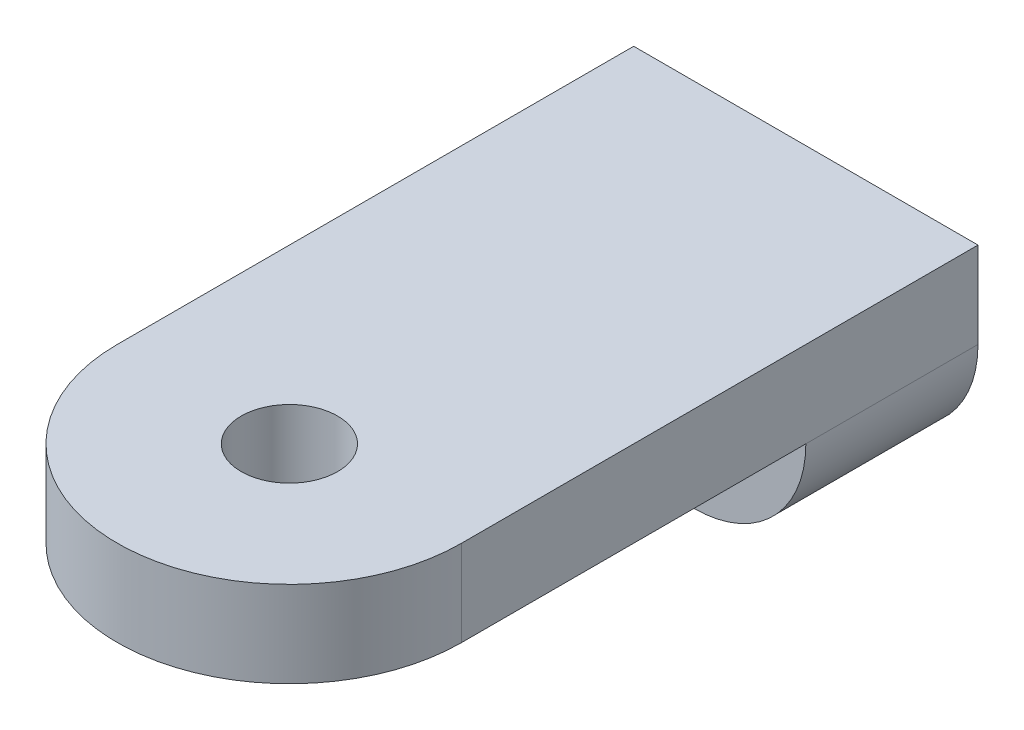
ISO-10303-21;
HEADER;
FILE_DESCRIPTION(('STEP AP214'),'2;1');
FILE_NAME('part.step','',(''),(''),'','','');
FILE_SCHEMA(('AUTOMOTIVE_DESIGN { 1 0 10303 214 1 1 1 1 }'));
ENDSEC;
DATA;
#1=APPLICATION_CONTEXT('core data for automotive mechanical design processes');
#2=APPLICATION_PROTOCOL_DEFINITION('international standard','automotive_design',2000,#1);
#3=PRODUCT_CONTEXT('',#1,'mechanical');
#4=PRODUCT('Part','Part','',(#3));
#5=PRODUCT_RELATED_PRODUCT_CATEGORY('part','',(#4));
#6=PRODUCT_DEFINITION_FORMATION('','',#4);
#7=PRODUCT_DEFINITION_CONTEXT('part definition',#1,'design');
#8=PRODUCT_DEFINITION('design','',#6,#7);
#9=PRODUCT_DEFINITION_SHAPE('','',#8);
#10=(LENGTH_UNIT() NAMED_UNIT(*) SI_UNIT(.MILLI.,.METRE.));
#11=(NAMED_UNIT(*) PLANE_ANGLE_UNIT() SI_UNIT($,.RADIAN.));
#12=(NAMED_UNIT(*) SI_UNIT($,.STERADIAN.) SOLID_ANGLE_UNIT());
#13=UNCERTAINTY_MEASURE_WITH_UNIT(LENGTH_MEASURE(1.E-05),#10,'distance_accuracy_value','');
#14=(GEOMETRIC_REPRESENTATION_CONTEXT(3) GLOBAL_UNCERTAINTY_ASSIGNED_CONTEXT((#13)) GLOBAL_UNIT_ASSIGNED_CONTEXT((#10,
#11,#12)) REPRESENTATION_CONTEXT('',''));
#15=CARTESIAN_POINT('',(0.,0.,0.));
#16=DIRECTION('',(0.,0.,1.));
#17=DIRECTION('',(1.,0.,0.));
#18=AXIS2_PLACEMENT_3D('',#15,#16,#17);
#19=CARTESIAN_POINT('',(0.,0.,0.));
#20=DIRECTION('',(0.,1.,0.));
#21=DIRECTION('',(0.,0.,1.));
#22=AXIS2_PLACEMENT_3D('',#19,#20,#21);
#23=PLANE('',#22);
#24=CARTESIAN_POINT('',(0.,0.,0.));
#25=DIRECTION('',(0.,1.,0.));
#26=DIRECTION('',(0.,0.,1.));
#27=AXIS2_PLACEMENT_3D('',#24,#25,#26);
#28=CIRCLE('',#27,3.556);
#29=CARTESIAN_POINT('',(0.,0.,3.556));
#30=VERTEX_POINT('',#29);
#31=EDGE_CURVE('E195',#30,#30,#28,.T.);
#32=ORIENTED_EDGE('',*,*,#31,.T.);
#33=EDGE_LOOP('',(#32));
#34=FACE_BOUND('',#33,.T.);
#35=DIRECTION('',(-1.,0.,0.));
#36=VECTOR('',#35,1.);
#37=CARTESIAN_POINT('',(-12.7,0.,-25.4));
#38=LINE('',#37,#36);
#39=CARTESIAN_POINT('',(12.7,0.,-25.4));
#40=VERTEX_POINT('',#39);
#41=CARTESIAN_POINT('',(-12.7,0.,-25.4));
#42=VERTEX_POINT('',#41);
#43=EDGE_CURVE('E181',#40,#42,#38,.T.);
#44=ORIENTED_EDGE('',*,*,#43,.F.);
#45=DIRECTION('',(0.,0.,-1.));
#46=VECTOR('',#45,1.);
#47=CARTESIAN_POINT('',(12.7,0.,0.));
#48=LINE('',#47,#46);
#49=CARTESIAN_POINT('',(12.7,0.,0.));
#50=VERTEX_POINT('',#49);
#51=EDGE_CURVE('E225',#50,#40,#48,.T.);
#52=ORIENTED_EDGE('',*,*,#51,.F.);
#53=CARTESIAN_POINT('',(0.,0.,0.));
#54=DIRECTION('',(0.,1.,0.));
#55=DIRECTION('',(0.,0.,1.));
#56=AXIS2_PLACEMENT_3D('',#53,#54,#55);
#57=CIRCLE('',#56,12.7);
#58=CARTESIAN_POINT('',(-12.7,0.,0.));
#59=VERTEX_POINT('',#58);
#60=EDGE_CURVE('E203',#59,#50,#57,.T.);
#61=ORIENTED_EDGE('',*,*,#60,.F.);
#62=DIRECTION('',(0.,0.,1.));
#63=VECTOR('',#62,1.);
#64=CARTESIAN_POINT('',(-12.7,0.,0.));
#65=LINE('',#64,#63);
#66=EDGE_CURVE('E212',#42,#59,#65,.T.);
#67=ORIENTED_EDGE('',*,*,#66,.F.);
#68=EDGE_LOOP('',(#44,#52,#61,#67));
#69=FACE_BOUND('',#68,.T.);
#70=ADVANCED_FACE('F42',(#34,#69),#23,.F.);
#71=CARTESIAN_POINT('',(0.,6.35,0.));
#72=DIRECTION('',(0.,1.,0.));
#73=DIRECTION('',(0.,0.,1.));
#74=AXIS2_PLACEMENT_3D('',#71,#72,#73);
#75=PLANE('',#74);
#76=CARTESIAN_POINT('',(0.,6.35,0.));
#77=DIRECTION('',(0.,1.,0.));
#78=DIRECTION('',(0.,0.,1.));
#79=AXIS2_PLACEMENT_3D('',#76,#77,#78);
#80=CIRCLE('',#79,12.7);
#81=CARTESIAN_POINT('',(-12.7,6.35,0.));
#82=VERTEX_POINT('',#81);
#83=CARTESIAN_POINT('',(12.7,6.35,0.));
#84=VERTEX_POINT('',#83);
#85=EDGE_CURVE('E207',#82,#84,#80,.T.);
#86=ORIENTED_EDGE('',*,*,#85,.T.);
#87=DIRECTION('',(0.,0.,-1.));
#88=VECTOR('',#87,1.);
#89=CARTESIAN_POINT('',(12.7,6.35,0.));
#90=LINE('',#89,#88);
#91=CARTESIAN_POINT('',(12.7,6.35,-38.1));
#92=VERTEX_POINT('',#91);
#93=EDGE_CURVE('E211',#84,#92,#90,.T.);
#94=ORIENTED_EDGE('',*,*,#93,.T.);
#95=DIRECTION('',(-1.,0.,0.));
#96=VECTOR('',#95,1.);
#97=CARTESIAN_POINT('',(-12.7,6.35,-38.1));
#98=LINE('',#97,#96);
#99=CARTESIAN_POINT('',(-12.7,6.35,-38.1));
#100=VERTEX_POINT('',#99);
#101=EDGE_CURVE('E215',#92,#100,#98,.T.);
#102=ORIENTED_EDGE('',*,*,#101,.T.);
#103=DIRECTION('',(0.,0.,1.));
#104=VECTOR('',#103,1.);
#105=CARTESIAN_POINT('',(-12.7,6.35,0.));
#106=LINE('',#105,#104);
#107=EDGE_CURVE('E218',#100,#82,#106,.T.);
#108=ORIENTED_EDGE('',*,*,#107,.T.);
#109=EDGE_LOOP('',(#86,#94,#102,#108));
#110=FACE_BOUND('',#109,.T.);
#111=CARTESIAN_POINT('',(0.,6.35,0.));
#112=DIRECTION('',(0.,1.,0.));
#113=DIRECTION('',(0.,0.,1.));
#114=AXIS2_PLACEMENT_3D('',#111,#112,#113);
#115=CIRCLE('',#114,3.556);
#116=CARTESIAN_POINT('',(0.,6.35,3.556));
#117=VERTEX_POINT('',#116);
#118=EDGE_CURVE('E199',#117,#117,#115,.T.);
#119=ORIENTED_EDGE('',*,*,#118,.F.);
#120=EDGE_LOOP('',(#119));
#121=FACE_BOUND('',#120,.T.);
#122=ADVANCED_FACE('F287',(#110,#121),#75,.T.);
#123=CARTESIAN_POINT('',(0.,6.35,0.));
#124=DIRECTION('',(0.,-1.,0.));
#125=DIRECTION('',(0.,0.,-1.));
#126=AXIS2_PLACEMENT_3D('',#123,#124,#125);
#127=CYLINDRICAL_SURFACE('',#126,12.7);
#128=ORIENTED_EDGE('',*,*,#60,.T.);
#129=DIRECTION('',(0.,-1.,0.));
#130=VECTOR('',#129,1.);
#131=CARTESIAN_POINT('',(12.7,6.35,0.));
#132=LINE('',#131,#130);
#133=EDGE_CURVE('E239',#84,#50,#132,.T.);
#134=ORIENTED_EDGE('',*,*,#133,.F.);
#135=ORIENTED_EDGE('',*,*,#85,.F.);
#136=DIRECTION('',(0.,-1.,0.));
#137=VECTOR('',#136,1.);
#138=CARTESIAN_POINT('',(-12.7,6.35,0.));
#139=LINE('',#138,#137);
#140=EDGE_CURVE('E221',#82,#59,#139,.T.);
#141=ORIENTED_EDGE('',*,*,#140,.T.);
#142=EDGE_LOOP('',(#128,#134,#135,#141));
#143=FACE_BOUND('',#142,.T.);
#144=ADVANCED_FACE('F284',(#143),#127,.T.);
#145=CARTESIAN_POINT('',(12.7,6.35,0.));
#146=DIRECTION('',(-1.,0.,0.));
#147=DIRECTION('',(0.,0.,1.));
#148=AXIS2_PLACEMENT_3D('',#145,#146,#147);
#149=PLANE('',#148);
#150=ORIENTED_EDGE('',*,*,#51,.T.);
#151=DIRECTION('',(0.,0.,1.));
#152=VECTOR('',#151,1.);
#153=CARTESIAN_POINT('',(12.7,0.,0.));
#154=LINE('',#153,#152);
#155=CARTESIAN_POINT('',(12.7,0.,-38.1));
#156=VERTEX_POINT('',#155);
#157=EDGE_CURVE('E11',#40,#156,#154,.F.);
#158=ORIENTED_EDGE('',*,*,#157,.T.);
#159=DIRECTION('',(0.,-1.,0.));
#160=VECTOR('',#159,1.);
#161=CARTESIAN_POINT('',(12.7,6.35,-38.1));
#162=LINE('',#161,#160);
#163=EDGE_CURVE('E236',#92,#156,#162,.T.);
#164=ORIENTED_EDGE('',*,*,#163,.F.);
#165=ORIENTED_EDGE('',*,*,#93,.F.);
#166=ORIENTED_EDGE('',*,*,#133,.T.);
#167=EDGE_LOOP('',(#150,#158,#164,#165,#166));
#168=FACE_BOUND('',#167,.T.);
#169=ADVANCED_FACE('F292',(#168),#149,.F.);
#170=CARTESIAN_POINT('',(-12.7,6.35,-38.1));
#171=DIRECTION('',(0.,0.,1.));
#172=DIRECTION('',(1.,0.,0.));
#173=AXIS2_PLACEMENT_3D('',#170,#171,#172);
#174=PLANE('',#173);
#175=CARTESIAN_POINT('',(0.,-0.9525,-38.1));
#176=DIRECTION('',(0.,0.,-1.));
#177=DIRECTION('',(-1.,0.,0.));
#178=AXIS2_PLACEMENT_3D('',#175,#176,#177);
#179=CIRCLE('',#178,6.477);
#180=CARTESIAN_POINT('',(-6.477,-0.9525,-38.1));
#181=VERTEX_POINT('',#180);
#182=EDGE_CURVE('E162',#181,#181,#179,.T.);
#183=ORIENTED_EDGE('',*,*,#182,.F.);
#184=EDGE_LOOP('',(#183));
#185=FACE_BOUND('',#184,.T.);
#186=DIRECTION('',(1.,0.,0.));
#187=VECTOR('',#186,1.);
#188=CARTESIAN_POINT('',(-12.7,-8.255,-38.1));
#189=LINE('',#188,#187);
#190=CARTESIAN_POINT('',(-4.445,-8.255,-38.1));
#191=VERTEX_POINT('',#190);
#192=CARTESIAN_POINT('',(4.445,-8.255,-38.1));
#193=VERTEX_POINT('',#192);
#194=EDGE_CURVE('E187',#191,#193,#189,.T.);
#195=ORIENTED_EDGE('',*,*,#194,.F.);
#196=CARTESIAN_POINT('',(-4.445,0.,-38.1));
#197=DIRECTION('',(0.,0.,1.));
#198=DIRECTION('',(1.,0.,0.));
#199=AXIS2_PLACEMENT_3D('',#196,#197,#198);
#200=CIRCLE('',#199,8.255);
#201=CARTESIAN_POINT('',(-12.7,0.,-38.1));
#202=VERTEX_POINT('',#201);
#203=EDGE_CURVE('E58',#191,#202,#200,.F.);
#204=ORIENTED_EDGE('',*,*,#203,.T.);
#205=DIRECTION('',(0.,-1.,0.));
#206=VECTOR('',#205,1.);
#207=CARTESIAN_POINT('',(-12.7,6.35,-38.1));
#208=LINE('',#207,#206);
#209=EDGE_CURVE('E233',#100,#202,#208,.T.);
#210=ORIENTED_EDGE('',*,*,#209,.F.);
#211=ORIENTED_EDGE('',*,*,#101,.F.);
#212=ORIENTED_EDGE('',*,*,#163,.T.);
#213=CARTESIAN_POINT('',(4.445,0.,-38.1));
#214=DIRECTION('',(0.,0.,1.));
#215=DIRECTION('',(1.,0.,0.));
#216=AXIS2_PLACEMENT_3D('',#213,#214,#215);
#217=CIRCLE('',#216,8.255);
#218=EDGE_CURVE('E251',#156,#193,#217,.F.);
#219=ORIENTED_EDGE('',*,*,#218,.T.);
#220=EDGE_LOOP('',(#195,#204,#210,#211,#212,#219));
#221=FACE_BOUND('',#220,.T.);
#222=ADVANCED_FACE('F290',(#185,#221),#174,.F.);
#223=CARTESIAN_POINT('',(-12.7,6.35,0.));
#224=DIRECTION('',(1.,0.,0.));
#225=DIRECTION('',(0.,0.,-1.));
#226=AXIS2_PLACEMENT_3D('',#223,#224,#225);
#227=PLANE('',#226);
#228=ORIENTED_EDGE('',*,*,#209,.T.);
#229=DIRECTION('',(0.,0.,-1.));
#230=VECTOR('',#229,1.);
#231=CARTESIAN_POINT('',(-12.7,0.,0.));
#232=LINE('',#231,#230);
#233=EDGE_CURVE('E256',#202,#42,#232,.F.);
#234=ORIENTED_EDGE('',*,*,#233,.T.);
#235=ORIENTED_EDGE('',*,*,#66,.T.);
#236=ORIENTED_EDGE('',*,*,#140,.F.);
#237=ORIENTED_EDGE('',*,*,#107,.F.);
#238=EDGE_LOOP('',(#228,#234,#235,#236,#237));
#239=FACE_BOUND('',#238,.T.);
#240=ADVANCED_FACE('F277',(#239),#227,.F.);
#241=CARTESIAN_POINT('',(0.,6.35,0.));
#242=DIRECTION('',(0.,-1.,0.));
#243=DIRECTION('',(0.,0.,-1.));
#244=AXIS2_PLACEMENT_3D('',#241,#242,#243);
#245=CYLINDRICAL_SURFACE('',#244,3.556);
#246=ORIENTED_EDGE('',*,*,#118,.T.);
#247=EDGE_LOOP('',(#246));
#248=FACE_BOUND('',#247,.T.);
#249=ORIENTED_EDGE('',*,*,#31,.F.);
#250=EDGE_LOOP('',(#249));
#251=FACE_BOUND('',#250,.T.);
#252=ADVANCED_FACE('F299',(#248,#251),#245,.F.);
#253=CARTESIAN_POINT('',(-12.7,-8.255,-25.4));
#254=DIRECTION('',(0.,0.,-1.));
#255=DIRECTION('',(-1.,0.,0.));
#256=AXIS2_PLACEMENT_3D('',#253,#254,#255);
#257=PLANE('',#256);
#258=DIRECTION('',(-1.,0.,0.));
#259=VECTOR('',#258,1.);
#260=CARTESIAN_POINT('',(-0.635000000000001,-3.175,-25.4));
#261=LINE('',#260,#259);
#262=CARTESIAN_POINT('',(0.635,-3.175,-25.4));
#263=VERTEX_POINT('',#262);
#264=CARTESIAN_POINT('',(-0.635000000000001,-3.175,-25.4));
#265=VERTEX_POINT('',#264);
#266=EDGE_CURVE('E171',#263,#265,#261,.T.);
#267=ORIENTED_EDGE('',*,*,#266,.F.);
#268=DIRECTION('',(0.,1.,0.));
#269=VECTOR('',#268,1.);
#270=CARTESIAN_POINT('',(0.634999999999999,-3.175,-25.4));
#271=LINE('',#270,#269);
#272=CARTESIAN_POINT('',(0.635,-6.35,-25.4));
#273=VERTEX_POINT('',#272);
#274=EDGE_CURVE('E134',#273,#263,#271,.T.);
#275=ORIENTED_EDGE('',*,*,#274,.F.);
#276=DIRECTION('',(1.,0.,0.));
#277=VECTOR('',#276,1.);
#278=CARTESIAN_POINT('',(-0.635,-6.35,-25.4));
#279=LINE('',#278,#277);
#280=CARTESIAN_POINT('',(-0.635,-6.35,-25.4));
#281=VERTEX_POINT('',#280);
#282=EDGE_CURVE('E154',#281,#273,#279,.T.);
#283=ORIENTED_EDGE('',*,*,#282,.F.);
#284=DIRECTION('',(0.,-1.,0.));
#285=VECTOR('',#284,1.);
#286=CARTESIAN_POINT('',(-0.635000000000001,-3.175,-25.4));
#287=LINE('',#286,#285);
#288=EDGE_CURVE('E159',#265,#281,#287,.T.);
#289=ORIENTED_EDGE('',*,*,#288,.F.);
#290=EDGE_LOOP('',(#267,#275,#283,#289));
#291=FACE_BOUND('',#290,.T.);
#292=ORIENTED_EDGE('',*,*,#43,.T.);
#293=CARTESIAN_POINT('',(-4.445,0.,-25.4));
#294=DIRECTION('',(0.,0.,-1.));
#295=DIRECTION('',(-1.,0.,0.));
#296=AXIS2_PLACEMENT_3D('',#293,#294,#295);
#297=CIRCLE('',#296,8.255);
#298=CARTESIAN_POINT('',(-4.445,-8.255,-25.4));
#299=VERTEX_POINT('',#298);
#300=EDGE_CURVE('E51',#42,#299,#297,.F.);
#301=ORIENTED_EDGE('',*,*,#300,.T.);
#302=DIRECTION('',(-1.,0.,0.));
#303=VECTOR('',#302,1.);
#304=CARTESIAN_POINT('',(-12.7,-8.255,-25.4));
#305=LINE('',#304,#303);
#306=CARTESIAN_POINT('',(4.445,-8.255,-25.4));
#307=VERTEX_POINT('',#306);
#308=EDGE_CURVE('E191',#307,#299,#305,.T.);
#309=ORIENTED_EDGE('',*,*,#308,.F.);
#310=CARTESIAN_POINT('',(4.445,0.,-25.4));
#311=DIRECTION('',(0.,0.,-1.));
#312=DIRECTION('',(-1.,0.,0.));
#313=AXIS2_PLACEMENT_3D('',#310,#311,#312);
#314=CIRCLE('',#313,8.255);
#315=EDGE_CURVE('E259',#307,#40,#314,.F.);
#316=ORIENTED_EDGE('',*,*,#315,.T.);
#317=EDGE_LOOP('',(#292,#301,#309,#316));
#318=FACE_BOUND('',#317,.T.);
#319=ADVANCED_FACE('F266',(#291,#318),#257,.F.);
#320=CARTESIAN_POINT('',(0.,-8.255,0.));
#321=DIRECTION('',(0.,1.,0.));
#322=DIRECTION('',(0.,0.,1.));
#323=AXIS2_PLACEMENT_3D('',#320,#321,#322);
#324=PLANE('',#323);
#325=ORIENTED_EDGE('',*,*,#308,.T.);
#326=DIRECTION('',(0.,0.,-1.));
#327=VECTOR('',#326,1.);
#328=CARTESIAN_POINT('',(-4.445,-8.255,0.));
#329=LINE('',#328,#327);
#330=EDGE_CURVE('E247',#299,#191,#329,.T.);
#331=ORIENTED_EDGE('',*,*,#330,.T.);
#332=ORIENTED_EDGE('',*,*,#194,.T.);
#333=DIRECTION('',(0.,0.,1.));
#334=VECTOR('',#333,1.);
#335=CARTESIAN_POINT('',(4.445,-8.255,0.));
#336=LINE('',#335,#334);
#337=EDGE_CURVE('E243',#193,#307,#336,.T.);
#338=ORIENTED_EDGE('',*,*,#337,.T.);
#339=EDGE_LOOP('',(#325,#331,#332,#338));
#340=FACE_BOUND('',#339,.T.);
#341=ADVANCED_FACE('F272',(#340),#324,.F.);
#342=CARTESIAN_POINT('',(0.634999999999999,-3.175,-28.575));
#343=DIRECTION('',(1.,0.,0.));
#344=DIRECTION('',(0.,1.,0.));
#345=AXIS2_PLACEMENT_3D('',#342,#343,#344);
#346=PLANE('',#345);
#347=ORIENTED_EDGE('',*,*,#274,.T.);
#348=DIRECTION('',(0.,0.,1.));
#349=VECTOR('',#348,1.);
#350=CARTESIAN_POINT('',(0.634999999999999,-3.175,-28.575));
#351=LINE('',#350,#349);
#352=CARTESIAN_POINT('',(0.634999999999999,-3.175,-28.575));
#353=VERTEX_POINT('',#352);
#354=EDGE_CURVE('E127',#353,#263,#351,.T.);
#355=ORIENTED_EDGE('',*,*,#354,.F.);
#356=DIRECTION('',(0.,1.,0.));
#357=VECTOR('',#356,1.);
#358=CARTESIAN_POINT('',(0.634999999999999,-3.175,-28.575));
#359=LINE('',#358,#357);
#360=CARTESIAN_POINT('',(0.635,-6.35,-28.575));
#361=VERTEX_POINT('',#360);
#362=EDGE_CURVE('E131',#361,#353,#359,.T.);
#363=ORIENTED_EDGE('',*,*,#362,.F.);
#364=DIRECTION('',(0.,0.,1.));
#365=VECTOR('',#364,1.);
#366=CARTESIAN_POINT('',(0.635,-6.35,-28.575));
#367=LINE('',#366,#365);
#368=EDGE_CURVE('E178',#361,#273,#367,.T.);
#369=ORIENTED_EDGE('',*,*,#368,.T.);
#370=EDGE_LOOP('',(#347,#355,#363,#369));
#371=FACE_BOUND('',#370,.T.);
#372=ADVANCED_FACE('F129',(#371),#346,.F.);
#373=CARTESIAN_POINT('',(-0.635,-6.35,-28.575));
#374=DIRECTION('',(0.,-1.,0.));
#375=DIRECTION('',(0.,0.,-1.));
#376=AXIS2_PLACEMENT_3D('',#373,#374,#375);
#377=PLANE('',#376);
#378=ORIENTED_EDGE('',*,*,#282,.T.);
#379=ORIENTED_EDGE('',*,*,#368,.F.);
#380=DIRECTION('',(1.,0.,0.));
#381=VECTOR('',#380,1.);
#382=CARTESIAN_POINT('',(-0.635,-6.35,-28.575));
#383=LINE('',#382,#381);
#384=CARTESIAN_POINT('',(-0.635,-6.35,-28.575));
#385=VERTEX_POINT('',#384);
#386=EDGE_CURVE('E140',#385,#361,#383,.T.);
#387=ORIENTED_EDGE('',*,*,#386,.F.);
#388=DIRECTION('',(0.,0.,1.));
#389=VECTOR('',#388,1.);
#390=CARTESIAN_POINT('',(-0.635,-6.35,-28.575));
#391=LINE('',#390,#389);
#392=EDGE_CURVE('E182',#385,#281,#391,.T.);
#393=ORIENTED_EDGE('',*,*,#392,.T.);
#394=EDGE_LOOP('',(#378,#379,#387,#393));
#395=FACE_BOUND('',#394,.T.);
#396=ADVANCED_FACE('F321',(#395),#377,.F.);
#397=CARTESIAN_POINT('',(-0.635000000000001,-3.175,-28.575));
#398=DIRECTION('',(-1.,0.,0.));
#399=DIRECTION('',(0.,-1.,0.));
#400=AXIS2_PLACEMENT_3D('',#397,#398,#399);
#401=PLANE('',#400);
#402=ORIENTED_EDGE('',*,*,#288,.T.);
#403=ORIENTED_EDGE('',*,*,#392,.F.);
#404=DIRECTION('',(0.,-1.,0.));
#405=VECTOR('',#404,1.);
#406=CARTESIAN_POINT('',(-0.635000000000001,-3.175,-28.575));
#407=LINE('',#406,#405);
#408=CARTESIAN_POINT('',(-0.635000000000001,-3.175,-28.575));
#409=VERTEX_POINT('',#408);
#410=EDGE_CURVE('E149',#409,#385,#407,.T.);
#411=ORIENTED_EDGE('',*,*,#410,.F.);
#412=DIRECTION('',(0.,0.,1.));
#413=VECTOR('',#412,1.);
#414=CARTESIAN_POINT('',(-0.635000000000001,-3.175,-28.575));
#415=LINE('',#414,#413);
#416=EDGE_CURVE('E139',#409,#265,#415,.T.);
#417=ORIENTED_EDGE('',*,*,#416,.T.);
#418=EDGE_LOOP('',(#402,#403,#411,#417));
#419=FACE_BOUND('',#418,.T.);
#420=ADVANCED_FACE('F324',(#419),#401,.F.);
#421=CARTESIAN_POINT('',(-0.635000000000001,-3.175,-28.575));
#422=DIRECTION('',(0.,1.,0.));
#423=DIRECTION('',(0.,0.,1.));
#424=AXIS2_PLACEMENT_3D('',#421,#422,#423);
#425=PLANE('',#424);
#426=ORIENTED_EDGE('',*,*,#266,.T.);
#427=ORIENTED_EDGE('',*,*,#416,.F.);
#428=DIRECTION('',(-1.,0.,0.));
#429=VECTOR('',#428,1.);
#430=CARTESIAN_POINT('',(-0.635000000000001,-3.175,-28.575));
#431=LINE('',#430,#429);
#432=EDGE_CURVE('E143',#353,#409,#431,.T.);
#433=ORIENTED_EDGE('',*,*,#432,.F.);
#434=ORIENTED_EDGE('',*,*,#354,.T.);
#435=EDGE_LOOP('',(#426,#427,#433,#434));
#436=FACE_BOUND('',#435,.T.);
#437=ADVANCED_FACE('F144',(#436),#425,.F.);
#438=CARTESIAN_POINT('',(0.,0.,-28.575));
#439=DIRECTION('',(0.,0.,1.));
#440=DIRECTION('',(1.,0.,0.));
#441=AXIS2_PLACEMENT_3D('',#438,#439,#440);
#442=PLANE('',#441);
#443=ORIENTED_EDGE('',*,*,#362,.T.);
#444=ORIENTED_EDGE('',*,*,#432,.T.);
#445=ORIENTED_EDGE('',*,*,#410,.T.);
#446=ORIENTED_EDGE('',*,*,#386,.T.);
#447=EDGE_LOOP('',(#443,#444,#445,#446));
#448=FACE_BOUND('',#447,.T.);
#449=ADVANCED_FACE('F151',(#448),#442,.T.);
#450=CARTESIAN_POINT('',(0.,-0.9525,-31.496));
#451=DIRECTION('',(0.,0.,-1.));
#452=DIRECTION('',(-1.,0.,0.));
#453=AXIS2_PLACEMENT_3D('',#450,#451,#452);
#454=CYLINDRICAL_SURFACE('',#453,6.477);
#455=CARTESIAN_POINT('',(0.,-0.9525,-31.496));
#456=DIRECTION('',(0.,0.,-1.));
#457=DIRECTION('',(-1.,0.,0.));
#458=AXIS2_PLACEMENT_3D('',#455,#456,#457);
#459=CIRCLE('',#458,6.477);
#460=CARTESIAN_POINT('',(-6.477,-0.9525,-31.496));
#461=VERTEX_POINT('',#460);
#462=EDGE_CURVE('E172',#461,#461,#459,.T.);
#463=ORIENTED_EDGE('',*,*,#462,.F.);
#464=EDGE_LOOP('',(#463));
#465=FACE_BOUND('',#464,.T.);
#466=ORIENTED_EDGE('',*,*,#182,.T.);
#467=EDGE_LOOP('',(#466));
#468=FACE_BOUND('',#467,.T.);
#469=ADVANCED_FACE('F333',(#465,#468),#454,.F.);
#470=CARTESIAN_POINT('',(0.,-0.9525,-31.496));
#471=DIRECTION('',(0.,0.,-1.));
#472=DIRECTION('',(-1.,0.,0.));
#473=AXIS2_PLACEMENT_3D('',#470,#471,#472);
#474=PLANE('',#473);
#475=ORIENTED_EDGE('',*,*,#462,.T.);
#476=EDGE_LOOP('',(#475));
#477=FACE_BOUND('',#476,.T.);
#478=ADVANCED_FACE('F336',(#477),#474,.T.);
#479=CARTESIAN_POINT('',(-4.445,0.,0.));
#480=DIRECTION('',(0.,0.,-1.));
#481=DIRECTION('',(-1.,0.,0.));
#482=AXIS2_PLACEMENT_3D('',#479,#480,#481);
#483=CYLINDRICAL_SURFACE('',#482,8.255);
#484=ORIENTED_EDGE('',*,*,#300,.F.);
#485=ORIENTED_EDGE('',*,*,#233,.F.);
#486=ORIENTED_EDGE('',*,*,#203,.F.);
#487=ORIENTED_EDGE('',*,*,#330,.F.);
#488=EDGE_LOOP('',(#484,#485,#486,#487));
#489=FACE_BOUND('',#488,.T.);
#490=ADVANCED_FACE('F274',(#489),#483,.T.);
#491=CARTESIAN_POINT('',(4.445,0.,0.));
#492=DIRECTION('',(0.,0.,1.));
#493=DIRECTION('',(1.,0.,0.));
#494=AXIS2_PLACEMENT_3D('',#491,#492,#493);
#495=CYLINDRICAL_SURFACE('',#494,8.255);
#496=ORIENTED_EDGE('',*,*,#218,.F.);
#497=ORIENTED_EDGE('',*,*,#157,.F.);
#498=ORIENTED_EDGE('',*,*,#315,.F.);
#499=ORIENTED_EDGE('',*,*,#337,.F.);
#500=EDGE_LOOP('',(#496,#497,#498,#499));
#501=FACE_BOUND('',#500,.T.);
#502=ADVANCED_FACE('F44',(#501),#495,.T.);
#503=CLOSED_SHELL('',(#70,#122,#144,#169,#222,#240,#252,#319,#341,#372,#396,#420,#437,#449,#469,
#478,#490,#502));
#504=MANIFOLD_SOLID_BREP('B2',#503);
#505=ADVANCED_BREP_SHAPE_REPRESENTATION('',(#18,#504),#14);
#506=SHAPE_DEFINITION_REPRESENTATION(#9,#505);
ENDSEC;
END-ISO-10303-21;
